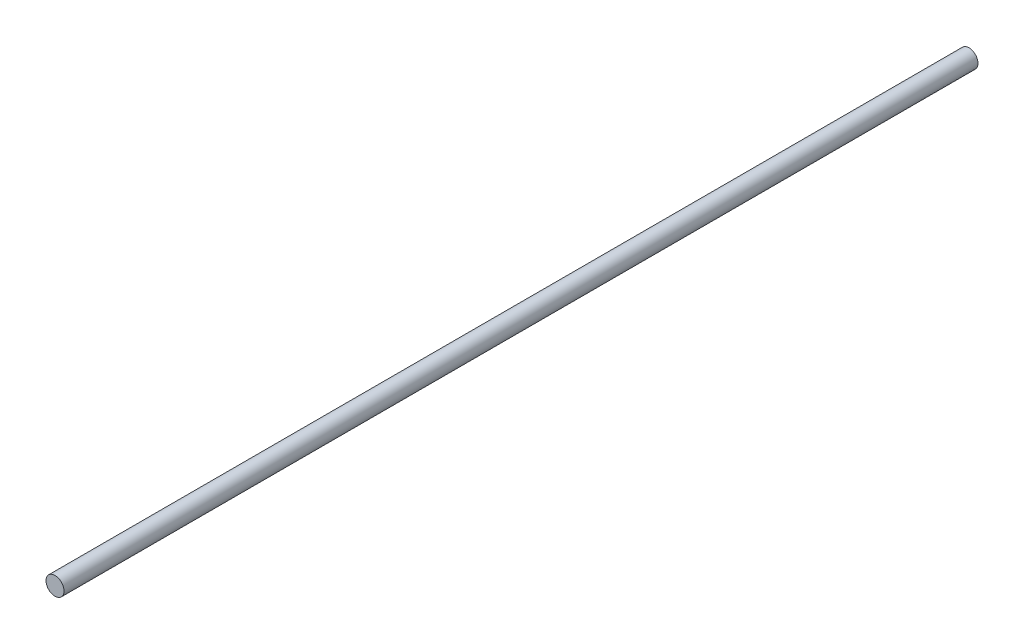
ISO-10303-21;
HEADER;
FILE_DESCRIPTION(('STEP AP214'),'2;1');
FILE_NAME('part.step','',(''),(''),'','','');
FILE_SCHEMA(('AUTOMOTIVE_DESIGN { 1 0 10303 214 1 1 1 1 }'));
ENDSEC;
DATA;
#1=APPLICATION_CONTEXT('core data for automotive mechanical design processes');
#2=APPLICATION_PROTOCOL_DEFINITION('international standard','automotive_design',2000,#1);
#3=PRODUCT_CONTEXT('',#1,'mechanical');
#4=PRODUCT('Part','Part','',(#3));
#5=PRODUCT_RELATED_PRODUCT_CATEGORY('part','',(#4));
#6=PRODUCT_DEFINITION_FORMATION('','',#4);
#7=PRODUCT_DEFINITION_CONTEXT('part definition',#1,'design');
#8=PRODUCT_DEFINITION('design','',#6,#7);
#9=PRODUCT_DEFINITION_SHAPE('','',#8);
#10=(LENGTH_UNIT() NAMED_UNIT(*) SI_UNIT(.MILLI.,.METRE.));
#11=(NAMED_UNIT(*) PLANE_ANGLE_UNIT() SI_UNIT($,.RADIAN.));
#12=(NAMED_UNIT(*) SI_UNIT($,.STERADIAN.) SOLID_ANGLE_UNIT());
#13=UNCERTAINTY_MEASURE_WITH_UNIT(LENGTH_MEASURE(1.E-05),#10,'distance_accuracy_value','');
#14=(GEOMETRIC_REPRESENTATION_CONTEXT(3) GLOBAL_UNCERTAINTY_ASSIGNED_CONTEXT((#13)) GLOBAL_UNIT_ASSIGNED_CONTEXT((#10,
#11,#12)) REPRESENTATION_CONTEXT('',''));
#15=CARTESIAN_POINT('',(0.,0.,0.));
#16=DIRECTION('',(0.,0.,1.));
#17=DIRECTION('',(1.,0.,0.));
#18=AXIS2_PLACEMENT_3D('',#15,#16,#17);
#19=CARTESIAN_POINT('',(0.,0.,241.3));
#20=DIRECTION('',(0.,0.,-1.));
#21=DIRECTION('',(-1.,0.,0.));
#22=AXIS2_PLACEMENT_3D('',#19,#20,#21);
#23=CYLINDRICAL_SURFACE('',#22,2.38125);
#24=CARTESIAN_POINT('',(0.,0.,241.3));
#25=DIRECTION('',(0.,0.,1.));
#26=DIRECTION('',(1.,0.,0.));
#27=AXIS2_PLACEMENT_3D('',#24,#25,#26);
#28=CIRCLE('',#27,2.38125);
#29=CARTESIAN_POINT('',(2.38125,0.,241.3));
#30=VERTEX_POINT('',#29);
#31=EDGE_CURVE('E10',#30,#30,#28,.T.);
#32=ORIENTED_EDGE('',*,*,#31,.F.);
#33=EDGE_LOOP('',(#32));
#34=FACE_BOUND('',#33,.T.);
#35=CARTESIAN_POINT('',(0.,0.,0.));
#36=DIRECTION('',(0.,0.,1.));
#37=DIRECTION('',(1.,0.,0.));
#38=AXIS2_PLACEMENT_3D('',#35,#36,#37);
#39=CIRCLE('',#38,2.38125);
#40=CARTESIAN_POINT('',(2.38125,0.,0.));
#41=VERTEX_POINT('',#40);
#42=EDGE_CURVE('E34',#41,#41,#39,.T.);
#43=ORIENTED_EDGE('',*,*,#42,.T.);
#44=EDGE_LOOP('',(#43));
#45=FACE_BOUND('',#44,.T.);
#46=ADVANCED_FACE('F31',(#34,#45),#23,.T.);
#47=CARTESIAN_POINT('',(0.,0.,241.3));
#48=DIRECTION('',(0.,0.,1.));
#49=DIRECTION('',(1.,0.,0.));
#50=AXIS2_PLACEMENT_3D('',#47,#48,#49);
#51=PLANE('',#50);
#52=ORIENTED_EDGE('',*,*,#31,.T.);
#53=EDGE_LOOP('',(#52));
#54=FACE_BOUND('',#53,.T.);
#55=ADVANCED_FACE('F46',(#54),#51,.T.);
#56=CARTESIAN_POINT('',(0.,0.,0.));
#57=DIRECTION('',(0.,0.,1.));
#58=DIRECTION('',(1.,0.,0.));
#59=AXIS2_PLACEMENT_3D('',#56,#57,#58);
#60=PLANE('',#59);
#61=ORIENTED_EDGE('',*,*,#42,.F.);
#62=EDGE_LOOP('',(#61));
#63=FACE_BOUND('',#62,.T.);
#64=ADVANCED_FACE('F44',(#63),#60,.F.);
#65=CLOSED_SHELL('',(#46,#55,#64));
#66=MANIFOLD_SOLID_BREP('B2',#65);
#67=ADVANCED_BREP_SHAPE_REPRESENTATION('',(#18,#66),#14);
#68=SHAPE_DEFINITION_REPRESENTATION(#9,#67);
ENDSEC;
END-ISO-10303-21;
